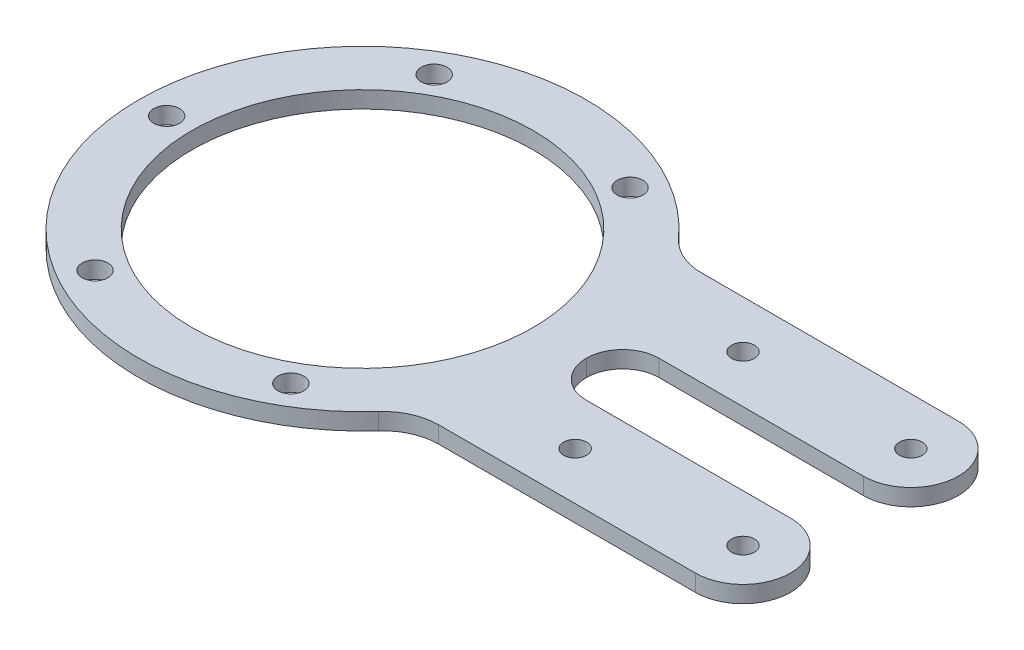
ISO-10303-21;
HEADER;
FILE_DESCRIPTION(('STEP AP214'),'2;1');
FILE_NAME('part.step','',(''),(''),'','','');
FILE_SCHEMA(('AUTOMOTIVE_DESIGN { 1 0 10303 214 1 1 1 1 }'));
ENDSEC;
DATA;
#1=APPLICATION_CONTEXT('core data for automotive mechanical design processes');
#2=APPLICATION_PROTOCOL_DEFINITION('international standard','automotive_design',2000,#1);
#3=PRODUCT_CONTEXT('',#1,'mechanical');
#4=PRODUCT('Part','Part','',(#3));
#5=PRODUCT_RELATED_PRODUCT_CATEGORY('part','',(#4));
#6=PRODUCT_DEFINITION_FORMATION('','',#4);
#7=PRODUCT_DEFINITION_CONTEXT('part definition',#1,'design');
#8=PRODUCT_DEFINITION('design','',#6,#7);
#9=PRODUCT_DEFINITION_SHAPE('','',#8);
#10=(LENGTH_UNIT() NAMED_UNIT(*) SI_UNIT(.MILLI.,.METRE.));
#11=(NAMED_UNIT(*) PLANE_ANGLE_UNIT() SI_UNIT($,.RADIAN.));
#12=(NAMED_UNIT(*) SI_UNIT($,.STERADIAN.) SOLID_ANGLE_UNIT());
#13=UNCERTAINTY_MEASURE_WITH_UNIT(LENGTH_MEASURE(1.E-05),#10,'distance_accuracy_value','');
#14=(GEOMETRIC_REPRESENTATION_CONTEXT(3) GLOBAL_UNCERTAINTY_ASSIGNED_CONTEXT((#13)) GLOBAL_UNIT_ASSIGNED_CONTEXT((#10,
#11,#12)) REPRESENTATION_CONTEXT('',''));
#15=CARTESIAN_POINT('',(0.,0.,0.));
#16=DIRECTION('',(0.,0.,1.));
#17=DIRECTION('',(1.,0.,0.));
#18=AXIS2_PLACEMENT_3D('',#15,#16,#17);
#19=CARTESIAN_POINT('',(32.368966619279,-69.7349028546265,-23.5));
#20=DIRECTION('',(0.,0.,-1.));
#21=DIRECTION('',(-1.,0.,0.));
#22=AXIS2_PLACEMENT_3D('',#19,#20,#21);
#23=PLANE('',#22);
#24=DIRECTION('',(1.,0.,0.));
#25=VECTOR('',#24,1.);
#26=CARTESIAN_POINT('',(32.368966619279,0.,-23.5));
#27=LINE('',#26,#25);
#28=CARTESIAN_POINT('',(37.1180549059349,0.,-23.5));
#29=VERTEX_POINT('',#28);
#30=CARTESIAN_POINT('',(83.,0.,-23.5));
#31=VERTEX_POINT('',#30);
#32=EDGE_CURVE('E115',#29,#31,#27,.T.);
#33=ORIENTED_EDGE('',*,*,#32,.F.);
#34=DIRECTION('',(0.,-1.,0.));
#35=VECTOR('',#34,1.);
#36=CARTESIAN_POINT('',(37.1180549059349,-69.7349028546265,-23.5));
#37=LINE('',#36,#35);
#38=CARTESIAN_POINT('',(37.1180549059349,3.,-23.5));
#39=VERTEX_POINT('',#38);
#40=EDGE_CURVE('E243',#29,#39,#37,.F.);
#41=ORIENTED_EDGE('',*,*,#40,.T.);
#42=DIRECTION('',(-1.,0.,0.));
#43=VECTOR('',#42,1.);
#44=CARTESIAN_POINT('',(32.368966619279,3.,-23.5));
#45=LINE('',#44,#43);
#46=CARTESIAN_POINT('',(83.,3.,-23.5));
#47=VERTEX_POINT('',#46);
#48=EDGE_CURVE('E129',#47,#39,#45,.T.);
#49=ORIENTED_EDGE('',*,*,#48,.F.);
#50=DIRECTION('',(0.,1.,0.));
#51=VECTOR('',#50,1.);
#52=CARTESIAN_POINT('',(83.,0.,-23.5));
#53=LINE('',#52,#51);
#54=EDGE_CURVE('E134',#31,#47,#53,.T.);
#55=ORIENTED_EDGE('',*,*,#54,.F.);
#56=EDGE_LOOP('',(#33,#41,#49,#55));
#57=FACE_BOUND('',#56,.T.);
#58=ADVANCED_FACE('F33',(#57),#23,.T.);
#59=CARTESIAN_POINT('',(39.4683417437318,-69.7349028546265,6.49999999999997));
#60=DIRECTION('',(0.,0.,-1.));
#61=DIRECTION('',(-1.,0.,0.));
#62=AXIS2_PLACEMENT_3D('',#59,#60,#61);
#63=PLANE('',#62);
#64=DIRECTION('',(1.,0.,0.));
#65=VECTOR('',#64,1.);
#66=CARTESIAN_POINT('',(39.4683417437318,0.,6.49999999999997));
#67=LINE('',#66,#65);
#68=CARTESIAN_POINT('',(46.5,0.,6.49999999999997));
#69=VERTEX_POINT('',#68);
#70=CARTESIAN_POINT('',(83.,0.,6.49999999999999));
#71=VERTEX_POINT('',#70);
#72=EDGE_CURVE('E212',#69,#71,#67,.T.);
#73=ORIENTED_EDGE('',*,*,#72,.F.);
#74=DIRECTION('',(0.,-1.,0.));
#75=VECTOR('',#74,1.);
#76=CARTESIAN_POINT('',(46.5,-69.7349028546265,6.49999999999997));
#77=LINE('',#76,#75);
#78=CARTESIAN_POINT('',(46.5,3.,6.49999999999997));
#79=VERTEX_POINT('',#78);
#80=EDGE_CURVE('E252',#69,#79,#77,.F.);
#81=ORIENTED_EDGE('',*,*,#80,.T.);
#82=DIRECTION('',(-1.,0.,0.));
#83=VECTOR('',#82,1.);
#84=CARTESIAN_POINT('',(39.4683417437318,3.,6.49999999999997));
#85=LINE('',#84,#83);
#86=CARTESIAN_POINT('',(83.,3.,6.49999999999999));
#87=VERTEX_POINT('',#86);
#88=EDGE_CURVE('E215',#87,#79,#85,.T.);
#89=ORIENTED_EDGE('',*,*,#88,.F.);
#90=DIRECTION('',(0.,1.,0.));
#91=VECTOR('',#90,1.);
#92=CARTESIAN_POINT('',(83.,0.,6.49999999999999));
#93=LINE('',#92,#91);
#94=EDGE_CURVE('E150',#71,#87,#93,.T.);
#95=ORIENTED_EDGE('',*,*,#94,.F.);
#96=EDGE_LOOP('',(#73,#81,#89,#95));
#97=FACE_BOUND('',#96,.T.);
#98=ADVANCED_FACE('F276',(#97),#63,.T.);
#99=CARTESIAN_POINT('',(0.,3.,0.));
#100=DIRECTION('',(0.,1.,0.));
#101=DIRECTION('',(0.,0.,1.));
#102=AXIS2_PLACEMENT_3D('',#99,#100,#101);
#103=PLANE('',#102);
#104=CARTESIAN_POINT('',(83.,3.,-15.));
#105=DIRECTION('',(0.,-1.,0.));
#106=DIRECTION('',(0.,0.,1.));
#107=AXIS2_PLACEMENT_3D('',#104,#105,#106);
#108=CIRCLE('',#107,8.5);
#109=CARTESIAN_POINT('',(83.,3.,-6.49999999999999));
#110=VERTEX_POINT('',#109);
#111=EDGE_CURVE('E138',#47,#110,#108,.T.);
#112=ORIENTED_EDGE('',*,*,#111,.F.);
#113=ORIENTED_EDGE('',*,*,#48,.T.);
#114=CARTESIAN_POINT('',(37.1180549059349,3.,-33.5));
#115=DIRECTION('',(0.,1.,0.));
#116=DIRECTION('',(0.,0.,1.));
#117=AXIS2_PLACEMENT_3D('',#114,#115,#116);
#118=CIRCLE('',#117,10.);
#119=CARTESIAN_POINT('',(29.6944439247479,3.,-26.8));
#120=VERTEX_POINT('',#119);
#121=EDGE_CURVE('E249',#39,#120,#118,.F.);
#122=ORIENTED_EDGE('',*,*,#121,.T.);
#123=CARTESIAN_POINT('',(0.,3.,0.));
#124=DIRECTION('',(0.,1.,0.));
#125=DIRECTION('',(0.,0.,1.));
#126=AXIS2_PLACEMENT_3D('',#123,#124,#125);
#127=CIRCLE('',#126,40.);
#128=CARTESIAN_POINT('',(29.6944439247479,3.,26.8));
#129=VERTEX_POINT('',#128);
#130=EDGE_CURVE('E231',#120,#129,#127,.T.);
#131=ORIENTED_EDGE('',*,*,#130,.T.);
#132=CARTESIAN_POINT('',(37.1180549059349,3.,33.5));
#133=DIRECTION('',(0.,1.,0.));
#134=DIRECTION('',(0.,0.,1.));
#135=AXIS2_PLACEMENT_3D('',#132,#133,#134);
#136=CIRCLE('',#135,10.);
#137=CARTESIAN_POINT('',(37.1180549059349,3.,23.5));
#138=VERTEX_POINT('',#137);
#139=EDGE_CURVE('E245',#129,#138,#136,.F.);
#140=ORIENTED_EDGE('',*,*,#139,.T.);
#141=DIRECTION('',(1.,0.,0.));
#142=VECTOR('',#141,1.);
#143=CARTESIAN_POINT('',(32.368966619279,3.,23.5));
#144=LINE('',#143,#142);
#145=CARTESIAN_POINT('',(83.,3.,23.5));
#146=VERTEX_POINT('',#145);
#147=EDGE_CURVE('E209',#138,#146,#144,.T.);
#148=ORIENTED_EDGE('',*,*,#147,.T.);
#149=CARTESIAN_POINT('',(83.,3.,15.));
#150=DIRECTION('',(0.,-1.,0.));
#151=DIRECTION('',(0.,0.,1.));
#152=AXIS2_PLACEMENT_3D('',#149,#150,#151);
#153=CIRCLE('',#152,8.5);
#154=EDGE_CURVE('E151',#87,#146,#153,.T.);
#155=ORIENTED_EDGE('',*,*,#154,.F.);
#156=ORIENTED_EDGE('',*,*,#88,.T.);
#157=CARTESIAN_POINT('',(46.5,3.,0.));
#158=DIRECTION('',(0.,1.,0.));
#159=DIRECTION('',(0.,0.,1.));
#160=AXIS2_PLACEMENT_3D('',#157,#158,#159);
#161=CIRCLE('',#160,6.5);
#162=CARTESIAN_POINT('',(40.,3.,0.));
#163=VERTEX_POINT('',#162);
#164=EDGE_CURVE('E55',#79,#163,#161,.F.);
#165=ORIENTED_EDGE('',*,*,#164,.T.);
#166=CARTESIAN_POINT('',(46.5,3.,0.));
#167=DIRECTION('',(0.,1.,0.));
#168=DIRECTION('',(0.,0.,1.));
#169=AXIS2_PLACEMENT_3D('',#166,#167,#168);
#170=CIRCLE('',#169,6.5);
#171=CARTESIAN_POINT('',(46.5,3.,-6.49999999999999));
#172=VERTEX_POINT('',#171);
#173=EDGE_CURVE('E42',#163,#172,#170,.F.);
#174=ORIENTED_EDGE('',*,*,#173,.T.);
#175=DIRECTION('',(1.,0.,0.));
#176=VECTOR('',#175,1.);
#177=CARTESIAN_POINT('',(100.,3.,-6.49999999999999));
#178=LINE('',#177,#176);
#179=EDGE_CURVE('E219',#172,#110,#178,.T.);
#180=ORIENTED_EDGE('',*,*,#179,.T.);
#181=EDGE_LOOP('',(#112,#113,#122,#131,#140,#148,#155,#156,#165,#174,#180));
#182=FACE_BOUND('',#181,.T.);
#183=CARTESIAN_POINT('',(-35.,3.,0.));
#184=DIRECTION('',(0.,1.,0.));
#185=DIRECTION('',(0.,0.,1.));
#186=AXIS2_PLACEMENT_3D('',#183,#184,#185);
#187=CIRCLE('',#186,2.30000000000005);
#188=CARTESIAN_POINT('',(-35.,3.,2.30000000000005));
#189=VERTEX_POINT('',#188);
#190=EDGE_CURVE('E143',#189,#189,#187,.T.);
#191=ORIENTED_EDGE('',*,*,#190,.F.);
#192=EDGE_LOOP('',(#191));
#193=FACE_BOUND('',#192,.T.);
#194=CARTESIAN_POINT('',(-17.5000000000002,3.,30.3108891324553));
#195=DIRECTION('',(0.,1.,0.));
#196=DIRECTION('',(0.,0.,1.));
#197=AXIS2_PLACEMENT_3D('',#194,#195,#196);
#198=CIRCLE('',#197,2.3);
#199=CARTESIAN_POINT('',(-17.5000000000002,3.,32.6108891324553));
#200=VERTEX_POINT('',#199);
#201=EDGE_CURVE('E174',#200,#200,#198,.T.);
#202=ORIENTED_EDGE('',*,*,#201,.F.);
#203=EDGE_LOOP('',(#202));
#204=FACE_BOUND('',#203,.T.);
#205=CARTESIAN_POINT('',(17.4999999999998,3.,30.3108891324555));
#206=DIRECTION('',(0.,1.,0.));
#207=DIRECTION('',(0.,0.,1.));
#208=AXIS2_PLACEMENT_3D('',#205,#206,#207);
#209=CIRCLE('',#208,2.3);
#210=CARTESIAN_POINT('',(17.4999999999998,3.,32.6108891324555));
#211=VERTEX_POINT('',#210);
#212=EDGE_CURVE('E168',#211,#211,#209,.T.);
#213=ORIENTED_EDGE('',*,*,#212,.F.);
#214=EDGE_LOOP('',(#213));
#215=FACE_BOUND('',#214,.T.);
#216=CARTESIAN_POINT('',(17.5000000000002,3.,-30.3108891324553));
#217=DIRECTION('',(0.,1.,0.));
#218=DIRECTION('',(0.,0.,1.));
#219=AXIS2_PLACEMENT_3D('',#216,#217,#218);
#220=CIRCLE('',#219,2.30000000000008);
#221=CARTESIAN_POINT('',(17.5000000000002,3.,-28.0108891324552));
#222=VERTEX_POINT('',#221);
#223=EDGE_CURVE('E162',#222,#222,#220,.T.);
#224=ORIENTED_EDGE('',*,*,#223,.F.);
#225=EDGE_LOOP('',(#224));
#226=FACE_BOUND('',#225,.T.);
#227=CARTESIAN_POINT('',(-17.5,3.,-30.3108891324554));
#228=DIRECTION('',(0.,1.,0.));
#229=DIRECTION('',(0.,0.,1.));
#230=AXIS2_PLACEMENT_3D('',#227,#228,#229);
#231=CIRCLE('',#230,2.30000000000017);
#232=CARTESIAN_POINT('',(-17.5,3.,-28.0108891324552));
#233=VERTEX_POINT('',#232);
#234=EDGE_CURVE('E161',#233,#233,#231,.T.);
#235=ORIENTED_EDGE('',*,*,#234,.F.);
#236=EDGE_LOOP('',(#235));
#237=FACE_BOUND('',#236,.T.);
#238=CARTESIAN_POINT('',(53.,3.,15.));
#239=DIRECTION('',(0.,1.,0.));
#240=DIRECTION('',(0.,0.,1.));
#241=AXIS2_PLACEMENT_3D('',#238,#239,#240);
#242=CIRCLE('',#241,2.04999999999999);
#243=CARTESIAN_POINT('',(53.,3.,17.05));
#244=VERTEX_POINT('',#243);
#245=EDGE_CURVE('E185',#244,#244,#242,.T.);
#246=ORIENTED_EDGE('',*,*,#245,.F.);
#247=EDGE_LOOP('',(#246));
#248=FACE_BOUND('',#247,.T.);
#249=CARTESIAN_POINT('',(83.,3.,-15.));
#250=DIRECTION('',(0.,1.,0.));
#251=DIRECTION('',(0.,0.,1.));
#252=AXIS2_PLACEMENT_3D('',#249,#250,#251);
#253=CIRCLE('',#252,2.04999999999999);
#254=CARTESIAN_POINT('',(83.,3.,-12.95));
#255=VERTEX_POINT('',#254);
#256=EDGE_CURVE('E198',#255,#255,#253,.T.);
#257=ORIENTED_EDGE('',*,*,#256,.F.);
#258=EDGE_LOOP('',(#257));
#259=FACE_BOUND('',#258,.T.);
#260=CARTESIAN_POINT('',(83.,3.,15.));
#261=DIRECTION('',(0.,1.,0.));
#262=DIRECTION('',(0.,0.,1.));
#263=AXIS2_PLACEMENT_3D('',#260,#261,#262);
#264=CIRCLE('',#263,2.04999999999999);
#265=CARTESIAN_POINT('',(83.,3.,17.05));
#266=VERTEX_POINT('',#265);
#267=EDGE_CURVE('E192',#266,#266,#264,.T.);
#268=ORIENTED_EDGE('',*,*,#267,.F.);
#269=EDGE_LOOP('',(#268));
#270=FACE_BOUND('',#269,.T.);
#271=CARTESIAN_POINT('',(53.,3.,-15.));
#272=DIRECTION('',(0.,1.,0.));
#273=DIRECTION('',(0.,0.,1.));
#274=AXIS2_PLACEMENT_3D('',#271,#272,#273);
#275=CIRCLE('',#274,2.04999999999999);
#276=CARTESIAN_POINT('',(53.,3.,-12.95));
#277=VERTEX_POINT('',#276);
#278=EDGE_CURVE('E191',#277,#277,#275,.T.);
#279=ORIENTED_EDGE('',*,*,#278,.F.);
#280=EDGE_LOOP('',(#279));
#281=FACE_BOUND('',#280,.T.);
#282=CARTESIAN_POINT('',(0.,3.,0.));
#283=DIRECTION('',(0.,1.,0.));
#284=DIRECTION('',(0.,0.,1.));
#285=AXIS2_PLACEMENT_3D('',#282,#283,#284);
#286=CIRCLE('',#285,30.5);
#287=CARTESIAN_POINT('',(0.,3.,30.5));
#288=VERTEX_POINT('',#287);
#289=EDGE_CURVE('E225',#288,#288,#286,.T.);
#290=ORIENTED_EDGE('',*,*,#289,.F.);
#291=EDGE_LOOP('',(#290));
#292=FACE_BOUND('',#291,.T.);
#293=ADVANCED_FACE('F261',(#182,#193,#204,#215,#226,#237,#248,#259,#270,#281,#292),#103,.T.);
#294=CARTESIAN_POINT('',(0.,0.,0.));
#295=DIRECTION('',(0.,1.,0.));
#296=DIRECTION('',(0.,0.,1.));
#297=AXIS2_PLACEMENT_3D('',#294,#295,#296);
#298=PLANE('',#297);
#299=CARTESIAN_POINT('',(-35.,0.,0.));
#300=DIRECTION('',(0.,1.,0.));
#301=DIRECTION('',(0.,0.,1.));
#302=AXIS2_PLACEMENT_3D('',#299,#300,#301);
#303=CIRCLE('',#302,2.30000000000005);
#304=CARTESIAN_POINT('',(-35.,0.,2.30000000000005));
#305=VERTEX_POINT('',#304);
#306=EDGE_CURVE('E177',#305,#305,#303,.T.);
#307=ORIENTED_EDGE('',*,*,#306,.T.);
#308=EDGE_LOOP('',(#307));
#309=FACE_BOUND('',#308,.T.);
#310=CARTESIAN_POINT('',(-17.5000000000002,0.,30.3108891324553));
#311=DIRECTION('',(0.,1.,0.));
#312=DIRECTION('',(0.,0.,1.));
#313=AXIS2_PLACEMENT_3D('',#310,#311,#312);
#314=CIRCLE('',#313,2.3);
#315=CARTESIAN_POINT('',(-17.5000000000002,0.,32.6108891324553));
#316=VERTEX_POINT('',#315);
#317=EDGE_CURVE('E171',#316,#316,#314,.T.);
#318=ORIENTED_EDGE('',*,*,#317,.T.);
#319=EDGE_LOOP('',(#318));
#320=FACE_BOUND('',#319,.T.);
#321=CARTESIAN_POINT('',(17.4999999999998,0.,30.3108891324555));
#322=DIRECTION('',(0.,1.,0.));
#323=DIRECTION('',(0.,0.,1.));
#324=AXIS2_PLACEMENT_3D('',#321,#322,#323);
#325=CIRCLE('',#324,2.3);
#326=CARTESIAN_POINT('',(17.4999999999998,0.,32.6108891324555));
#327=VERTEX_POINT('',#326);
#328=EDGE_CURVE('E165',#327,#327,#325,.T.);
#329=ORIENTED_EDGE('',*,*,#328,.T.);
#330=EDGE_LOOP('',(#329));
#331=FACE_BOUND('',#330,.T.);
#332=CARTESIAN_POINT('',(17.5000000000002,0.,-30.3108891324553));
#333=DIRECTION('',(0.,1.,0.));
#334=DIRECTION('',(0.,0.,1.));
#335=AXIS2_PLACEMENT_3D('',#332,#333,#334);
#336=CIRCLE('',#335,2.30000000000008);
#337=CARTESIAN_POINT('',(17.5000000000002,0.,-28.0108891324552));
#338=VERTEX_POINT('',#337);
#339=EDGE_CURVE('E158',#338,#338,#336,.T.);
#340=ORIENTED_EDGE('',*,*,#339,.T.);
#341=EDGE_LOOP('',(#340));
#342=FACE_BOUND('',#341,.T.);
#343=CARTESIAN_POINT('',(-17.5,0.,-30.3108891324554));
#344=DIRECTION('',(0.,1.,0.));
#345=DIRECTION('',(0.,0.,1.));
#346=AXIS2_PLACEMENT_3D('',#343,#344,#345);
#347=CIRCLE('',#346,2.30000000000017);
#348=CARTESIAN_POINT('',(-17.5,0.,-28.0108891324552));
#349=VERTEX_POINT('',#348);
#350=EDGE_CURVE('E182',#349,#349,#347,.T.);
#351=ORIENTED_EDGE('',*,*,#350,.T.);
#352=EDGE_LOOP('',(#351));
#353=FACE_BOUND('',#352,.T.);
#354=CARTESIAN_POINT('',(53.,0.,15.));
#355=DIRECTION('',(0.,1.,0.));
#356=DIRECTION('',(0.,0.,1.));
#357=AXIS2_PLACEMENT_3D('',#354,#355,#356);
#358=CIRCLE('',#357,2.04999999999999);
#359=CARTESIAN_POINT('',(53.,0.,17.05));
#360=VERTEX_POINT('',#359);
#361=EDGE_CURVE('E201',#360,#360,#358,.T.);
#362=ORIENTED_EDGE('',*,*,#361,.T.);
#363=EDGE_LOOP('',(#362));
#364=FACE_BOUND('',#363,.T.);
#365=CARTESIAN_POINT('',(83.,0.,-15.));
#366=DIRECTION('',(0.,1.,0.));
#367=DIRECTION('',(0.,0.,1.));
#368=AXIS2_PLACEMENT_3D('',#365,#366,#367);
#369=CIRCLE('',#368,2.04999999999999);
#370=CARTESIAN_POINT('',(83.,0.,-12.95));
#371=VERTEX_POINT('',#370);
#372=EDGE_CURVE('E195',#371,#371,#369,.T.);
#373=ORIENTED_EDGE('',*,*,#372,.T.);
#374=EDGE_LOOP('',(#373));
#375=FACE_BOUND('',#374,.T.);
#376=CARTESIAN_POINT('',(83.,0.,15.));
#377=DIRECTION('',(0.,1.,0.));
#378=DIRECTION('',(0.,0.,1.));
#379=AXIS2_PLACEMENT_3D('',#376,#377,#378);
#380=CIRCLE('',#379,2.04999999999999);
#381=CARTESIAN_POINT('',(83.,0.,17.05));
#382=VERTEX_POINT('',#381);
#383=EDGE_CURVE('E188',#382,#382,#380,.T.);
#384=ORIENTED_EDGE('',*,*,#383,.T.);
#385=EDGE_LOOP('',(#384));
#386=FACE_BOUND('',#385,.T.);
#387=CARTESIAN_POINT('',(53.,0.,-15.));
#388=DIRECTION('',(0.,1.,0.));
#389=DIRECTION('',(0.,0.,1.));
#390=AXIS2_PLACEMENT_3D('',#387,#388,#389);
#391=CIRCLE('',#390,2.04999999999999);
#392=CARTESIAN_POINT('',(53.,0.,-12.95));
#393=VERTEX_POINT('',#392);
#394=EDGE_CURVE('E206',#393,#393,#391,.T.);
#395=ORIENTED_EDGE('',*,*,#394,.T.);
#396=EDGE_LOOP('',(#395));
#397=FACE_BOUND('',#396,.T.);
#398=CARTESIAN_POINT('',(0.,0.,0.));
#399=DIRECTION('',(0.,1.,0.));
#400=DIRECTION('',(0.,0.,1.));
#401=AXIS2_PLACEMENT_3D('',#398,#399,#400);
#402=CIRCLE('',#401,40.);
#403=CARTESIAN_POINT('',(29.6944439247479,0.,-26.8));
#404=VERTEX_POINT('',#403);
#405=CARTESIAN_POINT('',(29.6944439247479,0.,26.8));
#406=VERTEX_POINT('',#405);
#407=EDGE_CURVE('E228',#404,#406,#402,.T.);
#408=ORIENTED_EDGE('',*,*,#407,.F.);
#409=CARTESIAN_POINT('',(37.1180549059349,0.,-33.5));
#410=DIRECTION('',(0.,1.,0.));
#411=DIRECTION('',(0.,0.,1.));
#412=AXIS2_PLACEMENT_3D('',#409,#410,#411);
#413=CIRCLE('',#412,10.);
#414=EDGE_CURVE('E123',#404,#29,#413,.T.);
#415=ORIENTED_EDGE('',*,*,#414,.T.);
#416=ORIENTED_EDGE('',*,*,#32,.T.);
#417=CARTESIAN_POINT('',(83.,0.,-15.));
#418=DIRECTION('',(0.,-1.,0.));
#419=DIRECTION('',(0.,0.,1.));
#420=AXIS2_PLACEMENT_3D('',#417,#418,#419);
#421=CIRCLE('',#420,8.5);
#422=CARTESIAN_POINT('',(83.,0.,-6.49999999999999));
#423=VERTEX_POINT('',#422);
#424=EDGE_CURVE('E120',#31,#423,#421,.T.);
#425=ORIENTED_EDGE('',*,*,#424,.T.);
#426=DIRECTION('',(-1.,0.,0.));
#427=VECTOR('',#426,1.);
#428=CARTESIAN_POINT('',(100.,0.,-6.49999999999999));
#429=LINE('',#428,#427);
#430=CARTESIAN_POINT('',(46.5,0.,-6.49999999999999));
#431=VERTEX_POINT('',#430);
#432=EDGE_CURVE('E128',#423,#431,#429,.T.);
#433=ORIENTED_EDGE('',*,*,#432,.T.);
#434=CARTESIAN_POINT('',(46.5,0.,0.));
#435=DIRECTION('',(0.,1.,0.));
#436=DIRECTION('',(0.,0.,1.));
#437=AXIS2_PLACEMENT_3D('',#434,#435,#436);
#438=CIRCLE('',#437,6.5);
#439=CARTESIAN_POINT('',(40.,0.,0.));
#440=VERTEX_POINT('',#439);
#441=EDGE_CURVE('E11',#431,#440,#438,.T.);
#442=ORIENTED_EDGE('',*,*,#441,.T.);
#443=CARTESIAN_POINT('',(46.5,0.,0.));
#444=DIRECTION('',(0.,1.,0.));
#445=DIRECTION('',(0.,0.,1.));
#446=AXIS2_PLACEMENT_3D('',#443,#444,#445);
#447=CIRCLE('',#446,6.5);
#448=EDGE_CURVE('E258',#440,#69,#447,.T.);
#449=ORIENTED_EDGE('',*,*,#448,.T.);
#450=ORIENTED_EDGE('',*,*,#72,.T.);
#451=CARTESIAN_POINT('',(83.,0.,15.));
#452=DIRECTION('',(0.,-1.,0.));
#453=DIRECTION('',(0.,0.,1.));
#454=AXIS2_PLACEMENT_3D('',#451,#452,#453);
#455=CIRCLE('',#454,8.5);
#456=CARTESIAN_POINT('',(83.,0.,23.5));
#457=VERTEX_POINT('',#456);
#458=EDGE_CURVE('E147',#71,#457,#455,.T.);
#459=ORIENTED_EDGE('',*,*,#458,.T.);
#460=DIRECTION('',(-1.,0.,0.));
#461=VECTOR('',#460,1.);
#462=CARTESIAN_POINT('',(32.368966619279,0.,23.5));
#463=LINE('',#462,#461);
#464=CARTESIAN_POINT('',(37.1180549059349,0.,23.5));
#465=VERTEX_POINT('',#464);
#466=EDGE_CURVE('E214',#457,#465,#463,.T.);
#467=ORIENTED_EDGE('',*,*,#466,.T.);
#468=CARTESIAN_POINT('',(37.1180549059349,0.,33.5));
#469=DIRECTION('',(0.,1.,0.));
#470=DIRECTION('',(0.,0.,1.));
#471=AXIS2_PLACEMENT_3D('',#468,#469,#470);
#472=CIRCLE('',#471,10.);
#473=EDGE_CURVE('E247',#465,#406,#472,.T.);
#474=ORIENTED_EDGE('',*,*,#473,.T.);
#475=EDGE_LOOP('',(#408,#415,#416,#425,#433,#442,#449,#450,#459,#467,#474));
#476=FACE_BOUND('',#475,.T.);
#477=CARTESIAN_POINT('',(0.,0.,0.));
#478=DIRECTION('',(0.,1.,0.));
#479=DIRECTION('',(0.,0.,1.));
#480=AXIS2_PLACEMENT_3D('',#477,#478,#479);
#481=CIRCLE('',#480,30.5);
#482=CARTESIAN_POINT('',(0.,0.,30.5));
#483=VERTEX_POINT('',#482);
#484=EDGE_CURVE('E224',#483,#483,#481,.T.);
#485=ORIENTED_EDGE('',*,*,#484,.T.);
#486=EDGE_LOOP('',(#485));
#487=FACE_BOUND('',#486,.T.);
#488=ADVANCED_FACE('F118',(#309,#320,#331,#342,#353,#364,#375,#386,#397,#476,#487),#298,.F.);
#489=CARTESIAN_POINT('',(0.,3.,0.));
#490=DIRECTION('',(0.,-1.,0.));
#491=DIRECTION('',(0.,0.,-1.));
#492=AXIS2_PLACEMENT_3D('',#489,#490,#491);
#493=CYLINDRICAL_SURFACE('',#492,40.);
#494=ORIENTED_EDGE('',*,*,#407,.T.);
#495=DIRECTION('',(0.,-1.,0.));
#496=VECTOR('',#495,1.);
#497=CARTESIAN_POINT('',(29.6944439247479,3.,26.8));
#498=LINE('',#497,#496);
#499=EDGE_CURVE('E238',#406,#129,#498,.F.);
#500=ORIENTED_EDGE('',*,*,#499,.T.);
#501=ORIENTED_EDGE('',*,*,#130,.F.);
#502=DIRECTION('',(0.,-1.,0.));
#503=VECTOR('',#502,1.);
#504=CARTESIAN_POINT('',(29.6944439247479,3.,-26.8));
#505=LINE('',#504,#503);
#506=EDGE_CURVE('E234',#120,#404,#505,.T.);
#507=ORIENTED_EDGE('',*,*,#506,.T.);
#508=EDGE_LOOP('',(#494,#500,#501,#507));
#509=FACE_BOUND('',#508,.T.);
#510=ADVANCED_FACE('F291',(#509),#493,.T.);
#511=CARTESIAN_POINT('',(0.,3.,0.));
#512=DIRECTION('',(0.,-1.,0.));
#513=DIRECTION('',(0.,0.,-1.));
#514=AXIS2_PLACEMENT_3D('',#511,#512,#513);
#515=CYLINDRICAL_SURFACE('',#514,30.5);
#516=ORIENTED_EDGE('',*,*,#289,.T.);
#517=EDGE_LOOP('',(#516));
#518=FACE_BOUND('',#517,.T.);
#519=ORIENTED_EDGE('',*,*,#484,.F.);
#520=EDGE_LOOP('',(#519));
#521=FACE_BOUND('',#520,.T.);
#522=ADVANCED_FACE('F313',(#518,#521),#515,.F.);
#523=CARTESIAN_POINT('',(100.,-69.7349028546265,-6.49999999999999));
#524=DIRECTION('',(0.,0.,1.));
#525=DIRECTION('',(1.,0.,0.));
#526=AXIS2_PLACEMENT_3D('',#523,#524,#525);
#527=PLANE('',#526);
#528=ORIENTED_EDGE('',*,*,#179,.F.);
#529=DIRECTION('',(0.,-1.,0.));
#530=VECTOR('',#529,1.);
#531=CARTESIAN_POINT('',(46.5,-69.7349028546265,-6.49999999999999));
#532=LINE('',#531,#530);
#533=EDGE_CURVE('E255',#172,#431,#532,.T.);
#534=ORIENTED_EDGE('',*,*,#533,.T.);
#535=ORIENTED_EDGE('',*,*,#432,.F.);
#536=DIRECTION('',(0.,1.,0.));
#537=VECTOR('',#536,1.);
#538=CARTESIAN_POINT('',(83.,0.,-6.49999999999999));
#539=LINE('',#538,#537);
#540=EDGE_CURVE('E137',#423,#110,#539,.T.);
#541=ORIENTED_EDGE('',*,*,#540,.T.);
#542=EDGE_LOOP('',(#528,#534,#535,#541));
#543=FACE_BOUND('',#542,.T.);
#544=ADVANCED_FACE('F267',(#543),#527,.T.);
#545=CARTESIAN_POINT('',(32.368966619279,-69.7349028546265,23.5));
#546=DIRECTION('',(0.,0.,1.));
#547=DIRECTION('',(1.,0.,0.));
#548=AXIS2_PLACEMENT_3D('',#545,#546,#547);
#549=PLANE('',#548);
#550=ORIENTED_EDGE('',*,*,#147,.F.);
#551=DIRECTION('',(0.,-1.,0.));
#552=VECTOR('',#551,1.);
#553=CARTESIAN_POINT('',(37.1180549059349,-69.7349028546265,23.5));
#554=LINE('',#553,#552);
#555=EDGE_CURVE('E241',#138,#465,#554,.T.);
#556=ORIENTED_EDGE('',*,*,#555,.T.);
#557=ORIENTED_EDGE('',*,*,#466,.F.);
#558=DIRECTION('',(0.,1.,0.));
#559=VECTOR('',#558,1.);
#560=CARTESIAN_POINT('',(83.,0.,23.5));
#561=LINE('',#560,#559);
#562=EDGE_CURVE('E154',#457,#146,#561,.T.);
#563=ORIENTED_EDGE('',*,*,#562,.T.);
#564=EDGE_LOOP('',(#550,#556,#557,#563));
#565=FACE_BOUND('',#564,.T.);
#566=ADVANCED_FACE('F284',(#565),#549,.T.);
#567=CARTESIAN_POINT('',(53.,0.,-15.));
#568=DIRECTION('',(0.,1.,0.));
#569=DIRECTION('',(0.,0.,1.));
#570=AXIS2_PLACEMENT_3D('',#567,#568,#569);
#571=CYLINDRICAL_SURFACE('',#570,2.04999999999999);
#572=ORIENTED_EDGE('',*,*,#394,.F.);
#573=EDGE_LOOP('',(#572));
#574=FACE_BOUND('',#573,.T.);
#575=ORIENTED_EDGE('',*,*,#278,.T.);
#576=EDGE_LOOP('',(#575));
#577=FACE_BOUND('',#576,.T.);
#578=ADVANCED_FACE('F343',(#574,#577),#571,.F.);
#579=CARTESIAN_POINT('',(83.,0.,15.));
#580=DIRECTION('',(0.,1.,0.));
#581=DIRECTION('',(0.,0.,1.));
#582=AXIS2_PLACEMENT_3D('',#579,#580,#581);
#583=CYLINDRICAL_SURFACE('',#582,2.04999999999999);
#584=ORIENTED_EDGE('',*,*,#383,.F.);
#585=EDGE_LOOP('',(#584));
#586=FACE_BOUND('',#585,.T.);
#587=ORIENTED_EDGE('',*,*,#267,.T.);
#588=EDGE_LOOP('',(#587));
#589=FACE_BOUND('',#588,.T.);
#590=ADVANCED_FACE('F349',(#586,#589),#583,.F.);
#591=CARTESIAN_POINT('',(83.,0.,-15.));
#592=DIRECTION('',(0.,1.,0.));
#593=DIRECTION('',(0.,0.,1.));
#594=AXIS2_PLACEMENT_3D('',#591,#592,#593);
#595=CYLINDRICAL_SURFACE('',#594,2.04999999999999);
#596=ORIENTED_EDGE('',*,*,#372,.F.);
#597=EDGE_LOOP('',(#596));
#598=FACE_BOUND('',#597,.T.);
#599=ORIENTED_EDGE('',*,*,#256,.T.);
#600=EDGE_LOOP('',(#599));
#601=FACE_BOUND('',#600,.T.);
#602=ADVANCED_FACE('F357',(#598,#601),#595,.F.);
#603=CARTESIAN_POINT('',(53.,0.,15.));
#604=DIRECTION('',(0.,1.,0.));
#605=DIRECTION('',(0.,0.,1.));
#606=AXIS2_PLACEMENT_3D('',#603,#604,#605);
#607=CYLINDRICAL_SURFACE('',#606,2.04999999999999);
#608=ORIENTED_EDGE('',*,*,#361,.F.);
#609=EDGE_LOOP('',(#608));
#610=FACE_BOUND('',#609,.T.);
#611=ORIENTED_EDGE('',*,*,#245,.T.);
#612=EDGE_LOOP('',(#611));
#613=FACE_BOUND('',#612,.T.);
#614=ADVANCED_FACE('F365',(#610,#613),#607,.F.);
#615=CARTESIAN_POINT('',(-17.5,0.,-30.3108891324554));
#616=DIRECTION('',(0.,1.,0.));
#617=DIRECTION('',(0.,0.,1.));
#618=AXIS2_PLACEMENT_3D('',#615,#616,#617);
#619=CYLINDRICAL_SURFACE('',#618,2.30000000000017);
#620=ORIENTED_EDGE('',*,*,#350,.F.);
#621=EDGE_LOOP('',(#620));
#622=FACE_BOUND('',#621,.T.);
#623=ORIENTED_EDGE('',*,*,#234,.T.);
#624=EDGE_LOOP('',(#623));
#625=FACE_BOUND('',#624,.T.);
#626=ADVANCED_FACE('F373',(#622,#625),#619,.F.);
#627=CARTESIAN_POINT('',(17.5000000000002,0.,-30.3108891324553));
#628=DIRECTION('',(0.,1.,0.));
#629=DIRECTION('',(0.,0.,1.));
#630=AXIS2_PLACEMENT_3D('',#627,#628,#629);
#631=CYLINDRICAL_SURFACE('',#630,2.30000000000008);
#632=ORIENTED_EDGE('',*,*,#339,.F.);
#633=EDGE_LOOP('',(#632));
#634=FACE_BOUND('',#633,.T.);
#635=ORIENTED_EDGE('',*,*,#223,.T.);
#636=EDGE_LOOP('',(#635));
#637=FACE_BOUND('',#636,.T.);
#638=ADVANCED_FACE('F381',(#634,#637),#631,.F.);
#639=CARTESIAN_POINT('',(17.4999999999998,0.,30.3108891324555));
#640=DIRECTION('',(0.,1.,0.));
#641=DIRECTION('',(0.,0.,1.));
#642=AXIS2_PLACEMENT_3D('',#639,#640,#641);
#643=CYLINDRICAL_SURFACE('',#642,2.3);
#644=ORIENTED_EDGE('',*,*,#328,.F.);
#645=EDGE_LOOP('',(#644));
#646=FACE_BOUND('',#645,.T.);
#647=ORIENTED_EDGE('',*,*,#212,.T.);
#648=EDGE_LOOP('',(#647));
#649=FACE_BOUND('',#648,.T.);
#650=ADVANCED_FACE('F389',(#646,#649),#643,.F.);
#651=CARTESIAN_POINT('',(-17.5000000000002,0.,30.3108891324553));
#652=DIRECTION('',(0.,1.,0.));
#653=DIRECTION('',(0.,0.,1.));
#654=AXIS2_PLACEMENT_3D('',#651,#652,#653);
#655=CYLINDRICAL_SURFACE('',#654,2.3);
#656=ORIENTED_EDGE('',*,*,#317,.F.);
#657=EDGE_LOOP('',(#656));
#658=FACE_BOUND('',#657,.T.);
#659=ORIENTED_EDGE('',*,*,#201,.T.);
#660=EDGE_LOOP('',(#659));
#661=FACE_BOUND('',#660,.T.);
#662=ADVANCED_FACE('F397',(#658,#661),#655,.F.);
#663=CARTESIAN_POINT('',(-35.,0.,0.));
#664=DIRECTION('',(0.,1.,0.));
#665=DIRECTION('',(0.,0.,1.));
#666=AXIS2_PLACEMENT_3D('',#663,#664,#665);
#667=CYLINDRICAL_SURFACE('',#666,2.30000000000005);
#668=ORIENTED_EDGE('',*,*,#306,.F.);
#669=EDGE_LOOP('',(#668));
#670=FACE_BOUND('',#669,.T.);
#671=ORIENTED_EDGE('',*,*,#190,.T.);
#672=EDGE_LOOP('',(#671));
#673=FACE_BOUND('',#672,.T.);
#674=ADVANCED_FACE('F405',(#670,#673),#667,.F.);
#675=CARTESIAN_POINT('',(83.,0.,15.));
#676=DIRECTION('',(0.,1.,0.));
#677=DIRECTION('',(0.,0.,1.));
#678=AXIS2_PLACEMENT_3D('',#675,#676,#677);
#679=CYLINDRICAL_SURFACE('',#678,8.5);
#680=ORIENTED_EDGE('',*,*,#154,.T.);
#681=ORIENTED_EDGE('',*,*,#562,.F.);
#682=ORIENTED_EDGE('',*,*,#458,.F.);
#683=ORIENTED_EDGE('',*,*,#94,.T.);
#684=EDGE_LOOP('',(#680,#681,#682,#683));
#685=FACE_BOUND('',#684,.T.);
#686=ADVANCED_FACE('F280',(#685),#679,.T.);
#687=CARTESIAN_POINT('',(83.,0.,-15.));
#688=DIRECTION('',(0.,1.,0.));
#689=DIRECTION('',(0.,0.,1.));
#690=AXIS2_PLACEMENT_3D('',#687,#688,#689);
#691=CYLINDRICAL_SURFACE('',#690,8.5);
#692=ORIENTED_EDGE('',*,*,#111,.T.);
#693=ORIENTED_EDGE('',*,*,#540,.F.);
#694=ORIENTED_EDGE('',*,*,#424,.F.);
#695=ORIENTED_EDGE('',*,*,#54,.T.);
#696=EDGE_LOOP('',(#692,#693,#694,#695));
#697=FACE_BOUND('',#696,.T.);
#698=ADVANCED_FACE('F133',(#697),#691,.T.);
#699=CARTESIAN_POINT('',(37.1180549059349,3.,33.5));
#700=DIRECTION('',(0.,-1.,0.));
#701=DIRECTION('',(0.,0.,-1.));
#702=AXIS2_PLACEMENT_3D('',#699,#700,#701);
#703=CYLINDRICAL_SURFACE('',#702,10.);
#704=ORIENTED_EDGE('',*,*,#473,.F.);
#705=ORIENTED_EDGE('',*,*,#555,.F.);
#706=ORIENTED_EDGE('',*,*,#139,.F.);
#707=ORIENTED_EDGE('',*,*,#499,.F.);
#708=EDGE_LOOP('',(#704,#705,#706,#707));
#709=FACE_BOUND('',#708,.T.);
#710=ADVANCED_FACE('F288',(#709),#703,.F.);
#711=CARTESIAN_POINT('',(37.1180549059349,3.,-33.5));
#712=DIRECTION('',(0.,-1.,0.));
#713=DIRECTION('',(0.,0.,-1.));
#714=AXIS2_PLACEMENT_3D('',#711,#712,#713);
#715=CYLINDRICAL_SURFACE('',#714,10.);
#716=ORIENTED_EDGE('',*,*,#414,.F.);
#717=ORIENTED_EDGE('',*,*,#506,.F.);
#718=ORIENTED_EDGE('',*,*,#121,.F.);
#719=ORIENTED_EDGE('',*,*,#40,.F.);
#720=EDGE_LOOP('',(#716,#717,#718,#719));
#721=FACE_BOUND('',#720,.T.);
#722=ADVANCED_FACE('F295',(#721),#715,.F.);
#723=CARTESIAN_POINT('',(46.5,3.,0.));
#724=DIRECTION('',(0.,-1.,0.));
#725=DIRECTION('',(0.,0.,-1.));
#726=AXIS2_PLACEMENT_3D('',#723,#724,#725);
#727=CYLINDRICAL_SURFACE('',#726,6.5);
#728=DIRECTION('',(0.,-1.,0.));
#729=VECTOR('',#728,1.);
#730=CARTESIAN_POINT('',(40.,3.,0.));
#731=LINE('',#730,#729);
#732=EDGE_CURVE('E37',#440,#163,#731,.F.);
#733=ORIENTED_EDGE('',*,*,#732,.F.);
#734=ORIENTED_EDGE('',*,*,#441,.F.);
#735=ORIENTED_EDGE('',*,*,#533,.F.);
#736=ORIENTED_EDGE('',*,*,#173,.F.);
#737=EDGE_LOOP('',(#733,#734,#735,#736));
#738=FACE_BOUND('',#737,.T.);
#739=ADVANCED_FACE('F35',(#738),#727,.F.);
#740=CARTESIAN_POINT('',(46.5,3.,0.));
#741=DIRECTION('',(0.,-1.,0.));
#742=DIRECTION('',(0.,0.,-1.));
#743=AXIS2_PLACEMENT_3D('',#740,#741,#742);
#744=CYLINDRICAL_SURFACE('',#743,6.5);
#745=ORIENTED_EDGE('',*,*,#448,.F.);
#746=ORIENTED_EDGE('',*,*,#732,.T.);
#747=ORIENTED_EDGE('',*,*,#164,.F.);
#748=ORIENTED_EDGE('',*,*,#80,.F.);
#749=EDGE_LOOP('',(#745,#746,#747,#748));
#750=FACE_BOUND('',#749,.T.);
#751=ADVANCED_FACE('F271',(#750),#744,.F.);
#752=CLOSED_SHELL('',(#58,#98,#293,#488,#510,#522,#544,#566,#578,#590,#602,#614,#626,#638,#650,
#662,#674,#686,#698,#710,#722,#739,#751));
#753=MANIFOLD_SOLID_BREP('B2',#752);
#754=ADVANCED_BREP_SHAPE_REPRESENTATION('',(#18,#753),#14);
#755=SHAPE_DEFINITION_REPRESENTATION(#9,#754);
ENDSEC;
END-ISO-10303-21;
